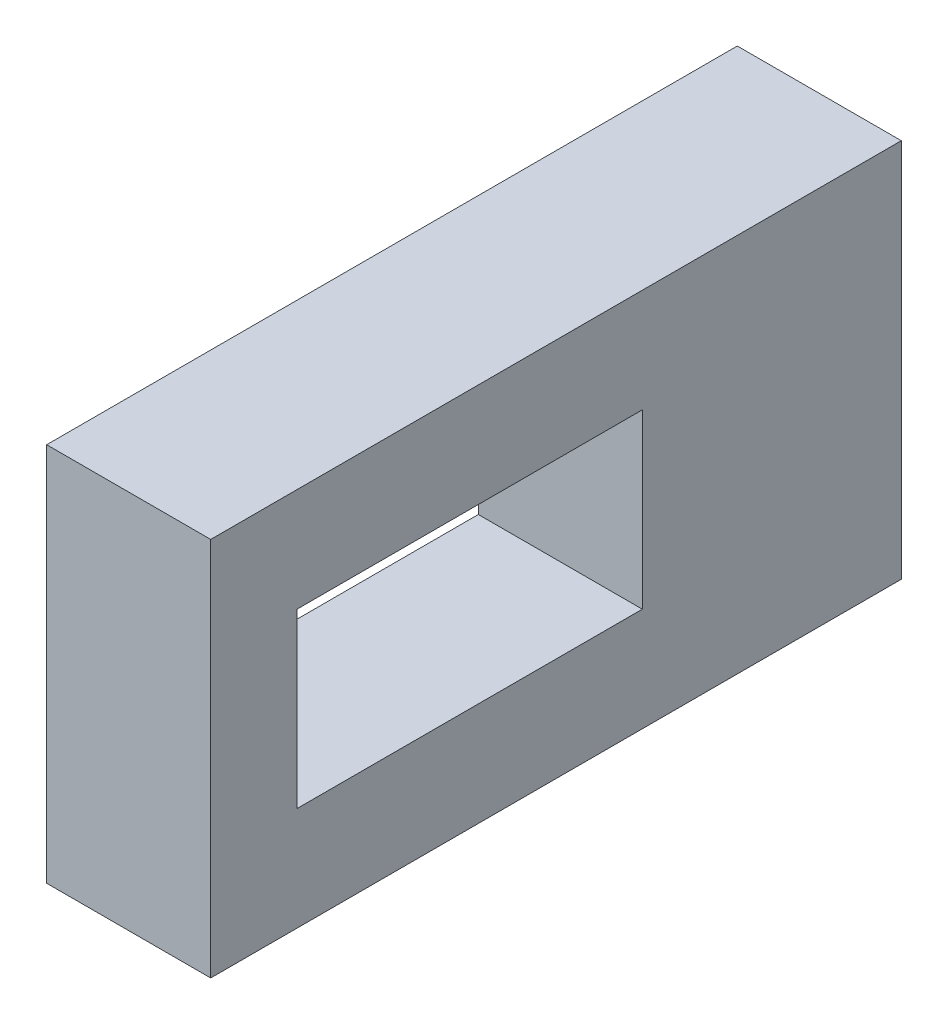
ISO-10303-21;
HEADER;
FILE_DESCRIPTION(('STEP AP214'),'2;1');
FILE_NAME('part.step','',(''),(''),'','','');
FILE_SCHEMA(('AUTOMOTIVE_DESIGN { 1 0 10303 214 1 1 1 1 }'));
ENDSEC;
DATA;
#1=APPLICATION_CONTEXT('core data for automotive mechanical design processes');
#2=APPLICATION_PROTOCOL_DEFINITION('international standard','automotive_design',2000,#1);
#3=PRODUCT_CONTEXT('',#1,'mechanical');
#4=PRODUCT('Part','Part','',(#3));
#5=PRODUCT_RELATED_PRODUCT_CATEGORY('part','',(#4));
#6=PRODUCT_DEFINITION_FORMATION('','',#4);
#7=PRODUCT_DEFINITION_CONTEXT('part definition',#1,'design');
#8=PRODUCT_DEFINITION('design','',#6,#7);
#9=PRODUCT_DEFINITION_SHAPE('','',#8);
#10=(LENGTH_UNIT() NAMED_UNIT(*) SI_UNIT(.MILLI.,.METRE.));
#11=(NAMED_UNIT(*) PLANE_ANGLE_UNIT() SI_UNIT($,.RADIAN.));
#12=(NAMED_UNIT(*) SI_UNIT($,.STERADIAN.) SOLID_ANGLE_UNIT());
#13=UNCERTAINTY_MEASURE_WITH_UNIT(LENGTH_MEASURE(1.E-05),#10,'distance_accuracy_value','');
#14=(GEOMETRIC_REPRESENTATION_CONTEXT(3) GLOBAL_UNCERTAINTY_ASSIGNED_CONTEXT((#13)) GLOBAL_UNIT_ASSIGNED_CONTEXT((#10,
#11,#12)) REPRESENTATION_CONTEXT('',''));
#15=CARTESIAN_POINT('',(0.,0.,0.));
#16=DIRECTION('',(0.,0.,1.));
#17=DIRECTION('',(1.,0.,0.));
#18=AXIS2_PLACEMENT_3D('',#15,#16,#17);
#19=CARTESIAN_POINT('',(-11.05,4.6,0.));
#20=DIRECTION('',(1.,0.,0.));
#21=DIRECTION('',(0.,0.,-1.));
#22=AXIS2_PLACEMENT_3D('',#19,#20,#21);
#23=PLANE('',#22);
#24=DIRECTION('',(0.,1.,0.));
#25=VECTOR('',#24,1.);
#26=CARTESIAN_POINT('',(-11.05,3.,1.5));
#27=LINE('',#26,#25);
#28=CARTESIAN_POINT('',(-11.05,4.,1.5));
#29=VERTEX_POINT('',#28);
#30=CARTESIAN_POINT('',(-11.05,3.,1.5));
#31=VERTEX_POINT('',#30);
#32=EDGE_CURVE('E116',#29,#31,#27,.F.);
#33=ORIENTED_EDGE('',*,*,#32,.T.);
#34=DIRECTION('',(0.,0.,-1.));
#35=VECTOR('',#34,1.);
#36=CARTESIAN_POINT('',(-11.05,3.,3.5));
#37=LINE('',#36,#35);
#38=CARTESIAN_POINT('',(-11.05,3.,3.5));
#39=VERTEX_POINT('',#38);
#40=EDGE_CURVE('E112',#31,#39,#37,.F.);
#41=ORIENTED_EDGE('',*,*,#40,.T.);
#42=DIRECTION('',(0.,1.,0.));
#43=VECTOR('',#42,1.);
#44=CARTESIAN_POINT('',(-11.05,4.,3.5));
#45=LINE('',#44,#43);
#46=CARTESIAN_POINT('',(-11.05,4.,3.5));
#47=VERTEX_POINT('',#46);
#48=EDGE_CURVE('E110',#39,#47,#45,.T.);
#49=ORIENTED_EDGE('',*,*,#48,.T.);
#50=DIRECTION('',(0.,0.,1.));
#51=VECTOR('',#50,1.);
#52=CARTESIAN_POINT('',(-11.05,4.,1.5));
#53=LINE('',#52,#51);
#54=EDGE_CURVE('E123',#47,#29,#53,.F.);
#55=ORIENTED_EDGE('',*,*,#54,.T.);
#56=EDGE_LOOP('',(#33,#41,#49,#55));
#57=FACE_BOUND('',#56,.T.);
#58=DIRECTION('',(0.,1.,0.));
#59=VECTOR('',#58,1.);
#60=CARTESIAN_POINT('',(-11.05,3.5,0.));
#61=LINE('',#60,#59);
#62=CARTESIAN_POINT('',(-11.05,2.4,0.));
#63=VERTEX_POINT('',#62);
#64=CARTESIAN_POINT('',(-11.05,4.6,0.));
#65=VERTEX_POINT('',#64);
#66=EDGE_CURVE('E80',#63,#65,#61,.T.);
#67=ORIENTED_EDGE('',*,*,#66,.T.);
#68=DIRECTION('',(0.,0.,1.));
#69=VECTOR('',#68,1.);
#70=CARTESIAN_POINT('',(-11.05,4.6,0.));
#71=LINE('',#70,#69);
#72=CARTESIAN_POINT('',(-11.05,4.6,4.));
#73=VERTEX_POINT('',#72);
#74=EDGE_CURVE('E92',#73,#65,#71,.F.);
#75=ORIENTED_EDGE('',*,*,#74,.F.);
#76=DIRECTION('',(0.,1.,0.));
#77=VECTOR('',#76,1.);
#78=CARTESIAN_POINT('',(-11.05,3.5,4.));
#79=LINE('',#78,#77);
#80=CARTESIAN_POINT('',(-11.05,2.4,4.));
#81=VERTEX_POINT('',#80);
#82=EDGE_CURVE('E20',#81,#73,#79,.T.);
#83=ORIENTED_EDGE('',*,*,#82,.F.);
#84=DIRECTION('',(0.,0.,-1.));
#85=VECTOR('',#84,1.);
#86=CARTESIAN_POINT('',(-11.05,2.4,0.));
#87=LINE('',#86,#85);
#88=EDGE_CURVE('E108',#63,#81,#87,.F.);
#89=ORIENTED_EDGE('',*,*,#88,.F.);
#90=EDGE_LOOP('',(#67,#75,#83,#89));
#91=FACE_BOUND('',#90,.T.);
#92=ADVANCED_FACE('F17',(#57,#91),#23,.T.);
#93=CARTESIAN_POINT('',(-11.525,3.5,4.));
#94=DIRECTION('',(0.,0.,1.));
#95=DIRECTION('',(1.,0.,0.));
#96=AXIS2_PLACEMENT_3D('',#93,#94,#95);
#97=PLANE('',#96);
#98=DIRECTION('',(0.,1.,0.));
#99=VECTOR('',#98,1.);
#100=CARTESIAN_POINT('',(-12.,2.4,4.));
#101=LINE('',#100,#99);
#102=CARTESIAN_POINT('',(-12.,2.4,4.));
#103=VERTEX_POINT('',#102);
#104=CARTESIAN_POINT('',(-12.,4.6,4.));
#105=VERTEX_POINT('',#104);
#106=EDGE_CURVE('E126',#103,#105,#101,.T.);
#107=ORIENTED_EDGE('',*,*,#106,.F.);
#108=DIRECTION('',(1.,0.,0.));
#109=VECTOR('',#108,1.);
#110=CARTESIAN_POINT('',(-11.05,2.4,4.));
#111=LINE('',#110,#109);
#112=EDGE_CURVE('E90',#81,#103,#111,.F.);
#113=ORIENTED_EDGE('',*,*,#112,.F.);
#114=ORIENTED_EDGE('',*,*,#82,.T.);
#115=DIRECTION('',(1.,0.,0.));
#116=VECTOR('',#115,1.);
#117=CARTESIAN_POINT('',(-12.,4.6,4.));
#118=LINE('',#117,#116);
#119=EDGE_CURVE('E87',#105,#73,#118,.T.);
#120=ORIENTED_EDGE('',*,*,#119,.F.);
#121=EDGE_LOOP('',(#107,#113,#114,#120));
#122=FACE_BOUND('',#121,.T.);
#123=ADVANCED_FACE('F85',(#122),#97,.T.);
#124=CARTESIAN_POINT('',(-12.,4.6,0.));
#125=DIRECTION('',(0.,1.,0.));
#126=DIRECTION('',(0.,0.,1.));
#127=AXIS2_PLACEMENT_3D('',#124,#125,#126);
#128=PLANE('',#127);
#129=DIRECTION('',(1.,0.,0.));
#130=VECTOR('',#129,1.);
#131=CARTESIAN_POINT('',(-11.525,4.6,0.));
#132=LINE('',#131,#130);
#133=CARTESIAN_POINT('',(-12.,4.6,0.));
#134=VERTEX_POINT('',#133);
#135=EDGE_CURVE('E102',#65,#134,#132,.F.);
#136=ORIENTED_EDGE('',*,*,#135,.T.);
#137=DIRECTION('',(0.,0.,1.));
#138=VECTOR('',#137,1.);
#139=CARTESIAN_POINT('',(-12.,4.6,0.));
#140=LINE('',#139,#138);
#141=EDGE_CURVE('E98',#105,#134,#140,.F.);
#142=ORIENTED_EDGE('',*,*,#141,.F.);
#143=ORIENTED_EDGE('',*,*,#119,.T.);
#144=ORIENTED_EDGE('',*,*,#74,.T.);
#145=EDGE_LOOP('',(#136,#142,#143,#144));
#146=FACE_BOUND('',#145,.T.);
#147=ADVANCED_FACE('F96',(#146),#128,.T.);
#148=CARTESIAN_POINT('',(-11.525,3.5,0.));
#149=DIRECTION('',(0.,0.,1.));
#150=DIRECTION('',(1.,0.,0.));
#151=AXIS2_PLACEMENT_3D('',#148,#149,#150);
#152=PLANE('',#151);
#153=ORIENTED_EDGE('',*,*,#66,.F.);
#154=DIRECTION('',(1.,0.,0.));
#155=VECTOR('',#154,1.);
#156=CARTESIAN_POINT('',(-11.05,2.4,0.));
#157=LINE('',#156,#155);
#158=CARTESIAN_POINT('',(-12.,2.4,0.));
#159=VERTEX_POINT('',#158);
#160=EDGE_CURVE('E105',#159,#63,#157,.T.);
#161=ORIENTED_EDGE('',*,*,#160,.F.);
#162=DIRECTION('',(0.,1.,0.));
#163=VECTOR('',#162,1.);
#164=CARTESIAN_POINT('',(-12.,2.4,0.));
#165=LINE('',#164,#163);
#166=EDGE_CURVE('E129',#134,#159,#165,.F.);
#167=ORIENTED_EDGE('',*,*,#166,.F.);
#168=ORIENTED_EDGE('',*,*,#135,.F.);
#169=EDGE_LOOP('',(#153,#161,#167,#168));
#170=FACE_BOUND('',#169,.T.);
#171=ADVANCED_FACE('F177',(#170),#152,.F.);
#172=CARTESIAN_POINT('',(-11.05,2.4,0.));
#173=DIRECTION('',(0.,-1.,0.));
#174=DIRECTION('',(0.,0.,-1.));
#175=AXIS2_PLACEMENT_3D('',#172,#173,#174);
#176=PLANE('',#175);
#177=ORIENTED_EDGE('',*,*,#160,.T.);
#178=ORIENTED_EDGE('',*,*,#88,.T.);
#179=ORIENTED_EDGE('',*,*,#112,.T.);
#180=DIRECTION('',(0.,0.,1.));
#181=VECTOR('',#180,1.);
#182=CARTESIAN_POINT('',(-12.,2.4,0.));
#183=LINE('',#182,#181);
#184=EDGE_CURVE('E132',#159,#103,#183,.T.);
#185=ORIENTED_EDGE('',*,*,#184,.F.);
#186=EDGE_LOOP('',(#177,#178,#179,#185));
#187=FACE_BOUND('',#186,.T.);
#188=ADVANCED_FACE('F174',(#187),#176,.T.);
#189=CARTESIAN_POINT('',(-11.05,4.,3.5));
#190=DIRECTION('',(0.,0.,1.));
#191=DIRECTION('',(1.,0.,0.));
#192=AXIS2_PLACEMENT_3D('',#189,#190,#191);
#193=PLANE('',#192);
#194=DIRECTION('',(1.,0.,0.));
#195=VECTOR('',#194,1.);
#196=CARTESIAN_POINT('',(-11.05,4.,3.5));
#197=LINE('',#196,#195);
#198=CARTESIAN_POINT('',(-12.,4.,3.5));
#199=VERTEX_POINT('',#198);
#200=EDGE_CURVE('E120',#199,#47,#197,.T.);
#201=ORIENTED_EDGE('',*,*,#200,.T.);
#202=ORIENTED_EDGE('',*,*,#48,.F.);
#203=DIRECTION('',(1.,0.,0.));
#204=VECTOR('',#203,1.);
#205=CARTESIAN_POINT('',(-11.05,3.,3.5));
#206=LINE('',#205,#204);
#207=CARTESIAN_POINT('',(-12.,3.,3.5));
#208=VERTEX_POINT('',#207);
#209=EDGE_CURVE('E114',#39,#208,#206,.F.);
#210=ORIENTED_EDGE('',*,*,#209,.T.);
#211=DIRECTION('',(0.,1.,0.));
#212=VECTOR('',#211,1.);
#213=CARTESIAN_POINT('',(-12.,2.4,3.5));
#214=LINE('',#213,#212);
#215=EDGE_CURVE('E135',#199,#208,#214,.F.);
#216=ORIENTED_EDGE('',*,*,#215,.F.);
#217=EDGE_LOOP('',(#201,#202,#210,#216));
#218=FACE_BOUND('',#217,.T.);
#219=ADVANCED_FACE('F155',(#218),#193,.F.);
#220=CARTESIAN_POINT('',(-11.05,3.,3.5));
#221=DIRECTION('',(0.,-1.,0.));
#222=DIRECTION('',(0.,0.,-1.));
#223=AXIS2_PLACEMENT_3D('',#220,#221,#222);
#224=PLANE('',#223);
#225=ORIENTED_EDGE('',*,*,#209,.F.);
#226=ORIENTED_EDGE('',*,*,#40,.F.);
#227=DIRECTION('',(-1.,0.,0.));
#228=VECTOR('',#227,1.);
#229=CARTESIAN_POINT('',(-11.05,3.,1.5));
#230=LINE('',#229,#228);
#231=CARTESIAN_POINT('',(-12.,3.,1.5));
#232=VERTEX_POINT('',#231);
#233=EDGE_CURVE('E118',#31,#232,#230,.T.);
#234=ORIENTED_EDGE('',*,*,#233,.T.);
#235=DIRECTION('',(0.,0.,1.));
#236=VECTOR('',#235,1.);
#237=CARTESIAN_POINT('',(-12.,3.,0.));
#238=LINE('',#237,#236);
#239=EDGE_CURVE('E138',#208,#232,#238,.F.);
#240=ORIENTED_EDGE('',*,*,#239,.F.);
#241=EDGE_LOOP('',(#225,#226,#234,#240));
#242=FACE_BOUND('',#241,.T.);
#243=ADVANCED_FACE('F151',(#242),#224,.F.);
#244=CARTESIAN_POINT('',(-11.05,3.,1.5));
#245=DIRECTION('',(0.,0.,-1.));
#246=DIRECTION('',(-1.,0.,0.));
#247=AXIS2_PLACEMENT_3D('',#244,#245,#246);
#248=PLANE('',#247);
#249=ORIENTED_EDGE('',*,*,#233,.F.);
#250=ORIENTED_EDGE('',*,*,#32,.F.);
#251=DIRECTION('',(1.,0.,0.));
#252=VECTOR('',#251,1.);
#253=CARTESIAN_POINT('',(-11.05,4.,1.5));
#254=LINE('',#253,#252);
#255=CARTESIAN_POINT('',(-12.,4.,1.5));
#256=VERTEX_POINT('',#255);
#257=EDGE_CURVE('E35',#29,#256,#254,.F.);
#258=ORIENTED_EDGE('',*,*,#257,.T.);
#259=DIRECTION('',(0.,1.,0.));
#260=VECTOR('',#259,1.);
#261=CARTESIAN_POINT('',(-12.,2.4,1.5));
#262=LINE('',#261,#260);
#263=EDGE_CURVE('E26',#232,#256,#262,.T.);
#264=ORIENTED_EDGE('',*,*,#263,.F.);
#265=EDGE_LOOP('',(#249,#250,#258,#264));
#266=FACE_BOUND('',#265,.T.);
#267=ADVANCED_FACE('F147',(#266),#248,.F.);
#268=CARTESIAN_POINT('',(-11.05,4.,1.5));
#269=DIRECTION('',(0.,1.,0.));
#270=DIRECTION('',(0.,0.,1.));
#271=AXIS2_PLACEMENT_3D('',#268,#269,#270);
#272=PLANE('',#271);
#273=ORIENTED_EDGE('',*,*,#257,.F.);
#274=ORIENTED_EDGE('',*,*,#54,.F.);
#275=ORIENTED_EDGE('',*,*,#200,.F.);
#276=DIRECTION('',(0.,0.,1.));
#277=VECTOR('',#276,1.);
#278=CARTESIAN_POINT('',(-12.,4.,0.));
#279=LINE('',#278,#277);
#280=EDGE_CURVE('E11',#256,#199,#279,.T.);
#281=ORIENTED_EDGE('',*,*,#280,.F.);
#282=EDGE_LOOP('',(#273,#274,#275,#281));
#283=FACE_BOUND('',#282,.T.);
#284=ADVANCED_FACE('F159',(#283),#272,.F.);
#285=CARTESIAN_POINT('',(-12.,2.4,0.));
#286=DIRECTION('',(-1.,0.,0.));
#287=DIRECTION('',(0.,0.,1.));
#288=AXIS2_PLACEMENT_3D('',#285,#286,#287);
#289=PLANE('',#288);
#290=ORIENTED_EDGE('',*,*,#263,.T.);
#291=ORIENTED_EDGE('',*,*,#280,.T.);
#292=ORIENTED_EDGE('',*,*,#215,.T.);
#293=ORIENTED_EDGE('',*,*,#239,.T.);
#294=EDGE_LOOP('',(#290,#291,#292,#293));
#295=FACE_BOUND('',#294,.T.);
#296=ORIENTED_EDGE('',*,*,#166,.T.);
#297=ORIENTED_EDGE('',*,*,#184,.T.);
#298=ORIENTED_EDGE('',*,*,#106,.T.);
#299=ORIENTED_EDGE('',*,*,#141,.T.);
#300=EDGE_LOOP('',(#296,#297,#298,#299));
#301=FACE_BOUND('',#300,.T.);
#302=ADVANCED_FACE('F143',(#295,#301),#289,.T.);
#303=CLOSED_SHELL('',(#92,#123,#147,#171,#188,#219,#243,#267,#284,#302));
#304=MANIFOLD_SOLID_BREP('B1',#303);
#305=ADVANCED_BREP_SHAPE_REPRESENTATION('',(#18,#304),#14);
#306=SHAPE_DEFINITION_REPRESENTATION(#9,#305);
ENDSEC;
END-ISO-10303-21;
